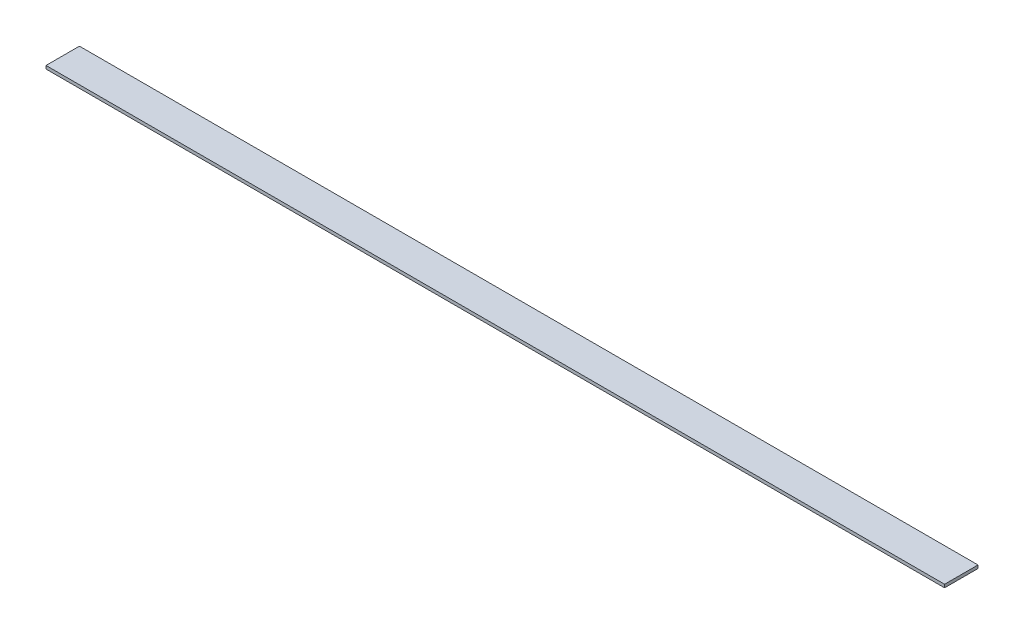
ISO-10303-21;
HEADER;
FILE_DESCRIPTION(('STEP AP214'),'2;1');
FILE_NAME('part.step','',(''),(''),'','','');
FILE_SCHEMA(('AUTOMOTIVE_DESIGN { 1 0 10303 214 1 1 1 1 }'));
ENDSEC;
DATA;
#1=APPLICATION_CONTEXT('core data for automotive mechanical design processes');
#2=APPLICATION_PROTOCOL_DEFINITION('international standard','automotive_design',2000,#1);
#3=PRODUCT_CONTEXT('',#1,'mechanical');
#4=PRODUCT('Part','Part','',(#3));
#5=PRODUCT_RELATED_PRODUCT_CATEGORY('part','',(#4));
#6=PRODUCT_DEFINITION_FORMATION('','',#4);
#7=PRODUCT_DEFINITION_CONTEXT('part definition',#1,'design');
#8=PRODUCT_DEFINITION('design','',#6,#7);
#9=PRODUCT_DEFINITION_SHAPE('','',#8);
#10=(LENGTH_UNIT() NAMED_UNIT(*) SI_UNIT(.MILLI.,.METRE.));
#11=(NAMED_UNIT(*) PLANE_ANGLE_UNIT() SI_UNIT($,.RADIAN.));
#12=(NAMED_UNIT(*) SI_UNIT($,.STERADIAN.) SOLID_ANGLE_UNIT());
#13=UNCERTAINTY_MEASURE_WITH_UNIT(LENGTH_MEASURE(1.E-05),#10,'distance_accuracy_value','');
#14=(GEOMETRIC_REPRESENTATION_CONTEXT(3) GLOBAL_UNCERTAINTY_ASSIGNED_CONTEXT((#13)) GLOBAL_UNIT_ASSIGNED_CONTEXT((#10,
#11,#12)) REPRESENTATION_CONTEXT('',''));
#15=CARTESIAN_POINT('',(0.,0.,0.));
#16=DIRECTION('',(0.,0.,1.));
#17=DIRECTION('',(1.,0.,0.));
#18=AXIS2_PLACEMENT_3D('',#15,#16,#17);
#19=CARTESIAN_POINT('',(215.,1.5,-8.));
#20=DIRECTION('',(-1.,0.,0.));
#21=DIRECTION('',(0.,0.,1.));
#22=AXIS2_PLACEMENT_3D('',#19,#20,#21);
#23=PLANE('',#22);
#24=DIRECTION('',(0.,0.,-1.));
#25=VECTOR('',#24,1.);
#26=CARTESIAN_POINT('',(215.,0.,-8.));
#27=LINE('',#26,#25);
#28=CARTESIAN_POINT('',(215.,0.,8.));
#29=VERTEX_POINT('',#28);
#30=CARTESIAN_POINT('',(215.,0.,-8.));
#31=VERTEX_POINT('',#30);
#32=EDGE_CURVE('E97',#29,#31,#27,.T.);
#33=ORIENTED_EDGE('',*,*,#32,.T.);
#34=DIRECTION('',(0.,-1.,0.));
#35=VECTOR('',#34,1.);
#36=CARTESIAN_POINT('',(215.,1.5,-8.));
#37=LINE('',#36,#35);
#38=CARTESIAN_POINT('',(215.,1.5,-8.));
#39=VERTEX_POINT('',#38);
#40=EDGE_CURVE('E11',#39,#31,#37,.T.);
#41=ORIENTED_EDGE('',*,*,#40,.F.);
#42=DIRECTION('',(0.,0.,-1.));
#43=VECTOR('',#42,1.);
#44=CARTESIAN_POINT('',(215.,1.5,-8.));
#45=LINE('',#44,#43);
#46=CARTESIAN_POINT('',(215.,1.5,8.));
#47=VERTEX_POINT('',#46);
#48=EDGE_CURVE('E85',#47,#39,#45,.T.);
#49=ORIENTED_EDGE('',*,*,#48,.F.);
#50=DIRECTION('',(0.,-1.,0.));
#51=VECTOR('',#50,1.);
#52=CARTESIAN_POINT('',(215.,1.5,8.));
#53=LINE('',#52,#51);
#54=EDGE_CURVE('E93',#47,#29,#53,.T.);
#55=ORIENTED_EDGE('',*,*,#54,.T.);
#56=EDGE_LOOP('',(#33,#41,#49,#55));
#57=FACE_BOUND('',#56,.T.);
#58=ADVANCED_FACE('F34',(#57),#23,.F.);
#59=CARTESIAN_POINT('',(-215.,1.5,-8.));
#60=DIRECTION('',(0.,0.,1.));
#61=DIRECTION('',(1.,0.,0.));
#62=AXIS2_PLACEMENT_3D('',#59,#60,#61);
#63=PLANE('',#62);
#64=DIRECTION('',(-1.,0.,0.));
#65=VECTOR('',#64,1.);
#66=CARTESIAN_POINT('',(-215.,0.,-8.));
#67=LINE('',#66,#65);
#68=CARTESIAN_POINT('',(-215.,0.,-8.));
#69=VERTEX_POINT('',#68);
#70=EDGE_CURVE('E89',#31,#69,#67,.T.);
#71=ORIENTED_EDGE('',*,*,#70,.T.);
#72=DIRECTION('',(0.,-1.,0.));
#73=VECTOR('',#72,1.);
#74=CARTESIAN_POINT('',(-215.,1.5,-8.));
#75=LINE('',#74,#73);
#76=CARTESIAN_POINT('',(-215.,1.5,-8.));
#77=VERTEX_POINT('',#76);
#78=EDGE_CURVE('E42',#77,#69,#75,.T.);
#79=ORIENTED_EDGE('',*,*,#78,.F.);
#80=DIRECTION('',(-1.,0.,0.));
#81=VECTOR('',#80,1.);
#82=CARTESIAN_POINT('',(-215.,1.5,-8.));
#83=LINE('',#82,#81);
#84=EDGE_CURVE('E80',#39,#77,#83,.T.);
#85=ORIENTED_EDGE('',*,*,#84,.F.);
#86=ORIENTED_EDGE('',*,*,#40,.T.);
#87=EDGE_LOOP('',(#71,#79,#85,#86));
#88=FACE_BOUND('',#87,.T.);
#89=ADVANCED_FACE('F88',(#88),#63,.F.);
#90=CARTESIAN_POINT('',(-215.,1.5,-8.));
#91=DIRECTION('',(1.,0.,0.));
#92=DIRECTION('',(0.,0.,-1.));
#93=AXIS2_PLACEMENT_3D('',#90,#91,#92);
#94=PLANE('',#93);
#95=DIRECTION('',(0.,0.,1.));
#96=VECTOR('',#95,1.);
#97=CARTESIAN_POINT('',(-215.,0.,-8.));
#98=LINE('',#97,#96);
#99=CARTESIAN_POINT('',(-215.,0.,8.));
#100=VERTEX_POINT('',#99);
#101=EDGE_CURVE('E67',#69,#100,#98,.T.);
#102=ORIENTED_EDGE('',*,*,#101,.T.);
#103=DIRECTION('',(0.,-1.,0.));
#104=VECTOR('',#103,1.);
#105=CARTESIAN_POINT('',(-215.,1.5,8.));
#106=LINE('',#105,#104);
#107=CARTESIAN_POINT('',(-215.,1.5,8.));
#108=VERTEX_POINT('',#107);
#109=EDGE_CURVE('E90',#108,#100,#106,.T.);
#110=ORIENTED_EDGE('',*,*,#109,.F.);
#111=DIRECTION('',(0.,0.,1.));
#112=VECTOR('',#111,1.);
#113=CARTESIAN_POINT('',(-215.,1.5,-8.));
#114=LINE('',#113,#112);
#115=EDGE_CURVE('E83',#77,#108,#114,.T.);
#116=ORIENTED_EDGE('',*,*,#115,.F.);
#117=ORIENTED_EDGE('',*,*,#78,.T.);
#118=EDGE_LOOP('',(#102,#110,#116,#117));
#119=FACE_BOUND('',#118,.T.);
#120=ADVANCED_FACE('F91',(#119),#94,.F.);
#121=CARTESIAN_POINT('',(-215.,1.5,8.));
#122=DIRECTION('',(0.,0.,-1.));
#123=DIRECTION('',(-1.,0.,0.));
#124=AXIS2_PLACEMENT_3D('',#121,#122,#123);
#125=PLANE('',#124);
#126=DIRECTION('',(1.,0.,0.));
#127=VECTOR('',#126,1.);
#128=CARTESIAN_POINT('',(-215.,0.,8.));
#129=LINE('',#128,#127);
#130=EDGE_CURVE('E73',#100,#29,#129,.T.);
#131=ORIENTED_EDGE('',*,*,#130,.T.);
#132=ORIENTED_EDGE('',*,*,#54,.F.);
#133=DIRECTION('',(1.,0.,0.));
#134=VECTOR('',#133,1.);
#135=CARTESIAN_POINT('',(-215.,1.5,8.));
#136=LINE('',#135,#134);
#137=EDGE_CURVE('E50',#108,#47,#136,.T.);
#138=ORIENTED_EDGE('',*,*,#137,.F.);
#139=ORIENTED_EDGE('',*,*,#109,.T.);
#140=EDGE_LOOP('',(#131,#132,#138,#139));
#141=FACE_BOUND('',#140,.T.);
#142=ADVANCED_FACE('F104',(#141),#125,.F.);
#143=CARTESIAN_POINT('',(0.,1.5,0.));
#144=DIRECTION('',(0.,1.,0.));
#145=DIRECTION('',(0.,0.,1.));
#146=AXIS2_PLACEMENT_3D('',#143,#144,#145);
#147=PLANE('',#146);
#148=ORIENTED_EDGE('',*,*,#48,.T.);
#149=ORIENTED_EDGE('',*,*,#84,.T.);
#150=ORIENTED_EDGE('',*,*,#115,.T.);
#151=ORIENTED_EDGE('',*,*,#137,.T.);
#152=EDGE_LOOP('',(#148,#149,#150,#151));
#153=FACE_BOUND('',#152,.T.);
#154=ADVANCED_FACE('F81',(#153),#147,.T.);
#155=CARTESIAN_POINT('',(0.,0.,0.));
#156=DIRECTION('',(0.,1.,0.));
#157=DIRECTION('',(0.,0.,1.));
#158=AXIS2_PLACEMENT_3D('',#155,#156,#157);
#159=PLANE('',#158);
#160=ORIENTED_EDGE('',*,*,#32,.F.);
#161=ORIENTED_EDGE('',*,*,#130,.F.);
#162=ORIENTED_EDGE('',*,*,#101,.F.);
#163=ORIENTED_EDGE('',*,*,#70,.F.);
#164=EDGE_LOOP('',(#160,#161,#162,#163));
#165=FACE_BOUND('',#164,.T.);
#166=ADVANCED_FACE('F107',(#165),#159,.F.);
#167=CLOSED_SHELL('',(#58,#89,#120,#142,#154,#166));
#168=MANIFOLD_SOLID_BREP('B2',#167);
#169=ADVANCED_BREP_SHAPE_REPRESENTATION('',(#18,#168),#14);
#170=SHAPE_DEFINITION_REPRESENTATION(#9,#169);
ENDSEC;
END-ISO-10303-21;
